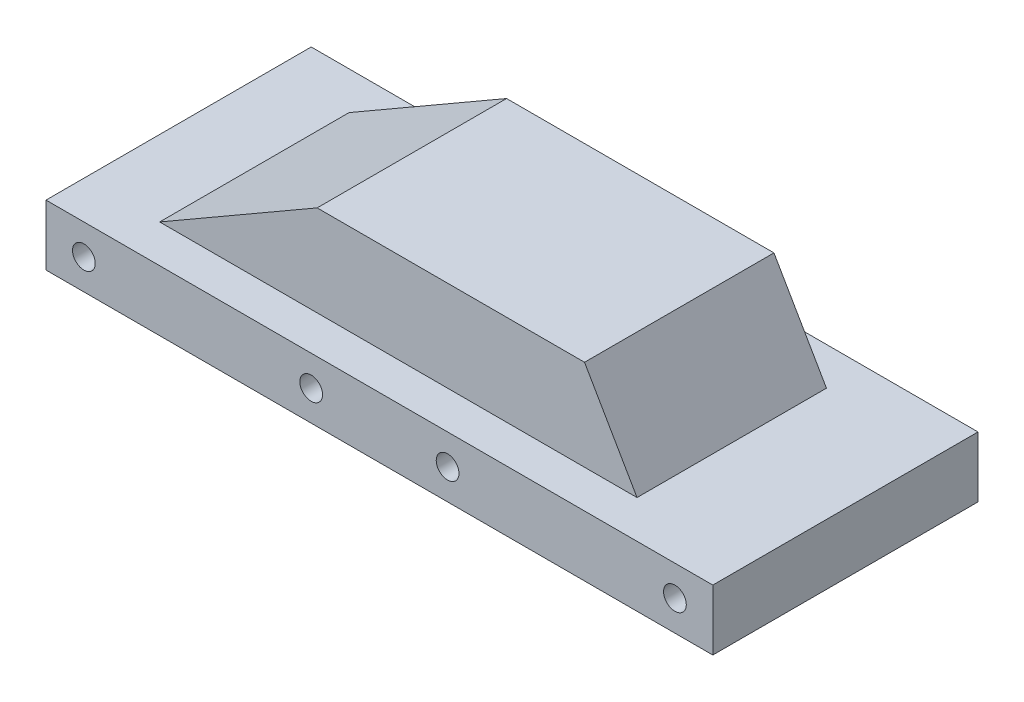
ISO-10303-21;
HEADER;
FILE_DESCRIPTION(('STEP AP214'),'2;1');
FILE_NAME('part.step','',(''),(''),'','','');
FILE_SCHEMA(('AUTOMOTIVE_DESIGN { 1 0 10303 214 1 1 1 1 }'));
ENDSEC;
DATA;
#1=APPLICATION_CONTEXT('core data for automotive mechanical design processes');
#2=APPLICATION_PROTOCOL_DEFINITION('international standard','automotive_design',2000,#1);
#3=PRODUCT_CONTEXT('',#1,'mechanical');
#4=PRODUCT('Part','Part','',(#3));
#5=PRODUCT_RELATED_PRODUCT_CATEGORY('part','',(#4));
#6=PRODUCT_DEFINITION_FORMATION('','',#4);
#7=PRODUCT_DEFINITION_CONTEXT('part definition',#1,'design');
#8=PRODUCT_DEFINITION('design','',#6,#7);
#9=PRODUCT_DEFINITION_SHAPE('','',#8);
#10=(LENGTH_UNIT() NAMED_UNIT(*) SI_UNIT(.MILLI.,.METRE.));
#11=(NAMED_UNIT(*) PLANE_ANGLE_UNIT() SI_UNIT($,.RADIAN.));
#12=(NAMED_UNIT(*) SI_UNIT($,.STERADIAN.) SOLID_ANGLE_UNIT());
#13=UNCERTAINTY_MEASURE_WITH_UNIT(LENGTH_MEASURE(1.E-05),#10,'distance_accuracy_value','');
#14=(GEOMETRIC_REPRESENTATION_CONTEXT(3) GLOBAL_UNCERTAINTY_ASSIGNED_CONTEXT((#13)) GLOBAL_UNIT_ASSIGNED_CONTEXT((#10,
#11,#12)) REPRESENTATION_CONTEXT('',''));
#15=CARTESIAN_POINT('',(0.,0.,0.));
#16=DIRECTION('',(0.,0.,1.));
#17=DIRECTION('',(1.,0.,0.));
#18=AXIS2_PLACEMENT_3D('',#15,#16,#17);
#19=CARTESIAN_POINT('',(44.,-4.,17.5));
#20=DIRECTION('',(1.,0.,0.));
#21=DIRECTION('',(0.,0.,-1.));
#22=AXIS2_PLACEMENT_3D('',#19,#20,#21);
#23=PLANE('',#22);
#24=DIRECTION('',(0.,1.,0.));
#25=VECTOR('',#24,1.);
#26=CARTESIAN_POINT('',(44.,-4.,-17.5));
#27=LINE('',#26,#25);
#28=CARTESIAN_POINT('',(44.,-4.,-17.5));
#29=VERTEX_POINT('',#28);
#30=CARTESIAN_POINT('',(44.,4.,-17.5));
#31=VERTEX_POINT('',#30);
#32=EDGE_CURVE('E33',#29,#31,#27,.T.);
#33=ORIENTED_EDGE('',*,*,#32,.T.);
#34=DIRECTION('',(0.,0.,-1.));
#35=VECTOR('',#34,1.);
#36=CARTESIAN_POINT('',(44.,4.,17.5));
#37=LINE('',#36,#35);
#38=CARTESIAN_POINT('',(44.,4.,17.5));
#39=VERTEX_POINT('',#38);
#40=EDGE_CURVE('E151',#39,#31,#37,.T.);
#41=ORIENTED_EDGE('',*,*,#40,.F.);
#42=DIRECTION('',(0.,1.,0.));
#43=VECTOR('',#42,1.);
#44=CARTESIAN_POINT('',(44.,-4.,17.5));
#45=LINE('',#44,#43);
#46=CARTESIAN_POINT('',(44.,-4.,17.5));
#47=VERTEX_POINT('',#46);
#48=EDGE_CURVE('E11',#47,#39,#45,.T.);
#49=ORIENTED_EDGE('',*,*,#48,.F.);
#50=DIRECTION('',(0.,0.,-1.));
#51=VECTOR('',#50,1.);
#52=CARTESIAN_POINT('',(44.,-4.,17.5));
#53=LINE('',#52,#51);
#54=EDGE_CURVE('E165',#47,#29,#53,.T.);
#55=ORIENTED_EDGE('',*,*,#54,.T.);
#56=EDGE_LOOP('',(#33,#41,#49,#55));
#57=FACE_BOUND('',#56,.T.);
#58=ADVANCED_FACE('F30',(#57),#23,.T.);
#59=CARTESIAN_POINT('',(-44.,-4.,17.5));
#60=DIRECTION('',(0.,0.,1.));
#61=DIRECTION('',(1.,0.,0.));
#62=AXIS2_PLACEMENT_3D('',#59,#60,#61);
#63=PLANE('',#62);
#64=CARTESIAN_POINT('',(-9.,0.,17.5));
#65=DIRECTION('',(0.,0.,-1.));
#66=DIRECTION('',(-1.,0.,0.));
#67=AXIS2_PLACEMENT_3D('',#64,#65,#66);
#68=CIRCLE('',#67,1.5);
#69=CARTESIAN_POINT('',(-10.5,0.,17.5));
#70=VERTEX_POINT('',#69);
#71=EDGE_CURVE('E130',#70,#70,#68,.T.);
#72=ORIENTED_EDGE('',*,*,#71,.T.);
#73=EDGE_LOOP('',(#72));
#74=FACE_BOUND('',#73,.T.);
#75=CARTESIAN_POINT('',(9.,0.,17.5));
#76=DIRECTION('',(0.,0.,-1.));
#77=DIRECTION('',(-1.,0.,0.));
#78=AXIS2_PLACEMENT_3D('',#75,#76,#77);
#79=CIRCLE('',#78,1.5);
#80=CARTESIAN_POINT('',(7.5,0.,17.5));
#81=VERTEX_POINT('',#80);
#82=EDGE_CURVE('E136',#81,#81,#79,.T.);
#83=ORIENTED_EDGE('',*,*,#82,.T.);
#84=EDGE_LOOP('',(#83));
#85=FACE_BOUND('',#84,.T.);
#86=CARTESIAN_POINT('',(39.,0.,17.5));
#87=DIRECTION('',(0.,0.,-1.));
#88=DIRECTION('',(-1.,0.,0.));
#89=AXIS2_PLACEMENT_3D('',#86,#87,#88);
#90=CIRCLE('',#89,1.5);
#91=CARTESIAN_POINT('',(37.5,0.,17.5));
#92=VERTEX_POINT('',#91);
#93=EDGE_CURVE('E142',#92,#92,#90,.T.);
#94=ORIENTED_EDGE('',*,*,#93,.T.);
#95=EDGE_LOOP('',(#94));
#96=FACE_BOUND('',#95,.T.);
#97=CARTESIAN_POINT('',(-39.,0.,17.5));
#98=DIRECTION('',(0.,0.,-1.));
#99=DIRECTION('',(-1.,0.,0.));
#100=AXIS2_PLACEMENT_3D('',#97,#98,#99);
#101=CIRCLE('',#100,1.5);
#102=CARTESIAN_POINT('',(-40.5,0.,17.5));
#103=VERTEX_POINT('',#102);
#104=EDGE_CURVE('E148',#103,#103,#101,.T.);
#105=ORIENTED_EDGE('',*,*,#104,.T.);
#106=EDGE_LOOP('',(#105));
#107=FACE_BOUND('',#106,.T.);
#108=ORIENTED_EDGE('',*,*,#48,.T.);
#109=DIRECTION('',(1.,0.,0.));
#110=VECTOR('',#109,1.);
#111=CARTESIAN_POINT('',(-44.,4.,17.5));
#112=LINE('',#111,#110);
#113=CARTESIAN_POINT('',(-44.,4.,17.5));
#114=VERTEX_POINT('',#113);
#115=EDGE_CURVE('E162',#114,#39,#112,.T.);
#116=ORIENTED_EDGE('',*,*,#115,.F.);
#117=DIRECTION('',(0.,1.,0.));
#118=VECTOR('',#117,1.);
#119=CARTESIAN_POINT('',(-44.,-4.,17.5));
#120=LINE('',#119,#118);
#121=CARTESIAN_POINT('',(-44.,-4.,17.5));
#122=VERTEX_POINT('',#121);
#123=EDGE_CURVE('E38',#122,#114,#120,.T.);
#124=ORIENTED_EDGE('',*,*,#123,.F.);
#125=DIRECTION('',(1.,0.,0.));
#126=VECTOR('',#125,1.);
#127=CARTESIAN_POINT('',(-44.,-4.,17.5));
#128=LINE('',#127,#126);
#129=EDGE_CURVE('E174',#122,#47,#128,.T.);
#130=ORIENTED_EDGE('',*,*,#129,.T.);
#131=EDGE_LOOP('',(#108,#116,#124,#130));
#132=FACE_BOUND('',#131,.T.);
#133=ADVANCED_FACE('F190',(#74,#85,#96,#107,#132),#63,.T.);
#134=CARTESIAN_POINT('',(-44.,-4.,17.5));
#135=DIRECTION('',(-1.,0.,0.));
#136=DIRECTION('',(0.,0.,1.));
#137=AXIS2_PLACEMENT_3D('',#134,#135,#136);
#138=PLANE('',#137);
#139=ORIENTED_EDGE('',*,*,#123,.T.);
#140=DIRECTION('',(0.,0.,1.));
#141=VECTOR('',#140,1.);
#142=CARTESIAN_POINT('',(-44.,4.,17.5));
#143=LINE('',#142,#141);
#144=CARTESIAN_POINT('',(-44.,4.,-17.5));
#145=VERTEX_POINT('',#144);
#146=EDGE_CURVE('E159',#145,#114,#143,.T.);
#147=ORIENTED_EDGE('',*,*,#146,.F.);
#148=DIRECTION('',(0.,1.,0.));
#149=VECTOR('',#148,1.);
#150=CARTESIAN_POINT('',(-44.,-4.,-17.5));
#151=LINE('',#150,#149);
#152=CARTESIAN_POINT('',(-44.,-4.,-17.5));
#153=VERTEX_POINT('',#152);
#154=EDGE_CURVE('E177',#153,#145,#151,.T.);
#155=ORIENTED_EDGE('',*,*,#154,.F.);
#156=DIRECTION('',(0.,0.,1.));
#157=VECTOR('',#156,1.);
#158=CARTESIAN_POINT('',(-44.,-4.,17.5));
#159=LINE('',#158,#157);
#160=EDGE_CURVE('E171',#153,#122,#159,.T.);
#161=ORIENTED_EDGE('',*,*,#160,.T.);
#162=EDGE_LOOP('',(#139,#147,#155,#161));
#163=FACE_BOUND('',#162,.T.);
#164=ADVANCED_FACE('F196',(#163),#138,.T.);
#165=CARTESIAN_POINT('',(-44.,-4.,-17.5));
#166=DIRECTION('',(0.,0.,-1.));
#167=DIRECTION('',(-1.,0.,0.));
#168=AXIS2_PLACEMENT_3D('',#165,#166,#167);
#169=PLANE('',#168);
#170=CARTESIAN_POINT('',(-9.,0.,-17.5));
#171=DIRECTION('',(0.,0.,-1.));
#172=DIRECTION('',(-1.,0.,0.));
#173=AXIS2_PLACEMENT_3D('',#170,#171,#172);
#174=CIRCLE('',#173,1.5);
#175=CARTESIAN_POINT('',(-10.5,0.,-17.5));
#176=VERTEX_POINT('',#175);
#177=EDGE_CURVE('E129',#176,#176,#174,.T.);
#178=ORIENTED_EDGE('',*,*,#177,.F.);
#179=EDGE_LOOP('',(#178));
#180=FACE_BOUND('',#179,.T.);
#181=CARTESIAN_POINT('',(9.,0.,-17.5));
#182=DIRECTION('',(0.,0.,-1.));
#183=DIRECTION('',(-1.,0.,0.));
#184=AXIS2_PLACEMENT_3D('',#181,#182,#183);
#185=CIRCLE('',#184,1.5);
#186=CARTESIAN_POINT('',(7.5,0.,-17.5));
#187=VERTEX_POINT('',#186);
#188=EDGE_CURVE('E133',#187,#187,#185,.T.);
#189=ORIENTED_EDGE('',*,*,#188,.F.);
#190=EDGE_LOOP('',(#189));
#191=FACE_BOUND('',#190,.T.);
#192=CARTESIAN_POINT('',(39.,0.,-17.5));
#193=DIRECTION('',(0.,0.,-1.));
#194=DIRECTION('',(-1.,0.,0.));
#195=AXIS2_PLACEMENT_3D('',#192,#193,#194);
#196=CIRCLE('',#195,1.5);
#197=CARTESIAN_POINT('',(37.5,0.,-17.5));
#198=VERTEX_POINT('',#197);
#199=EDGE_CURVE('E139',#198,#198,#196,.T.);
#200=ORIENTED_EDGE('',*,*,#199,.F.);
#201=EDGE_LOOP('',(#200));
#202=FACE_BOUND('',#201,.T.);
#203=CARTESIAN_POINT('',(-39.,0.,-17.5));
#204=DIRECTION('',(0.,0.,-1.));
#205=DIRECTION('',(-1.,0.,0.));
#206=AXIS2_PLACEMENT_3D('',#203,#204,#205);
#207=CIRCLE('',#206,1.5);
#208=CARTESIAN_POINT('',(-40.5,0.,-17.5));
#209=VERTEX_POINT('',#208);
#210=EDGE_CURVE('E145',#209,#209,#207,.T.);
#211=ORIENTED_EDGE('',*,*,#210,.F.);
#212=EDGE_LOOP('',(#211));
#213=FACE_BOUND('',#212,.T.);
#214=ORIENTED_EDGE('',*,*,#154,.T.);
#215=DIRECTION('',(-1.,0.,0.));
#216=VECTOR('',#215,1.);
#217=CARTESIAN_POINT('',(-44.,4.,-17.5));
#218=LINE('',#217,#216);
#219=EDGE_CURVE('E156',#31,#145,#218,.T.);
#220=ORIENTED_EDGE('',*,*,#219,.F.);
#221=ORIENTED_EDGE('',*,*,#32,.F.);
#222=DIRECTION('',(-1.,0.,0.));
#223=VECTOR('',#222,1.);
#224=CARTESIAN_POINT('',(-44.,-4.,-17.5));
#225=LINE('',#224,#223);
#226=EDGE_CURVE('E168',#29,#153,#225,.T.);
#227=ORIENTED_EDGE('',*,*,#226,.T.);
#228=EDGE_LOOP('',(#214,#220,#221,#227));
#229=FACE_BOUND('',#228,.T.);
#230=ADVANCED_FACE('F184',(#180,#191,#202,#213,#229),#169,.T.);
#231=CARTESIAN_POINT('',(44.,-4.,-17.5));
#232=DIRECTION('',(0.,-1.,0.));
#233=DIRECTION('',(0.,0.,-1.));
#234=AXIS2_PLACEMENT_3D('',#231,#232,#233);
#235=PLANE('',#234);
#236=ORIENTED_EDGE('',*,*,#54,.F.);
#237=ORIENTED_EDGE('',*,*,#129,.F.);
#238=ORIENTED_EDGE('',*,*,#160,.F.);
#239=ORIENTED_EDGE('',*,*,#226,.F.);
#240=EDGE_LOOP('',(#236,#237,#238,#239));
#241=FACE_BOUND('',#240,.T.);
#242=ADVANCED_FACE('F193',(#241),#235,.T.);
#243=CARTESIAN_POINT('',(44.,4.,-17.5));
#244=DIRECTION('',(0.,-1.,0.));
#245=DIRECTION('',(0.,0.,-1.));
#246=AXIS2_PLACEMENT_3D('',#243,#244,#245);
#247=PLANE('',#246);
#248=DIRECTION('',(0.,0.,-1.));
#249=VECTOR('',#248,1.);
#250=CARTESIAN_POINT('',(29.,4.,12.5));
#251=LINE('',#250,#249);
#252=CARTESIAN_POINT('',(29.,4.,12.5));
#253=VERTEX_POINT('',#252);
#254=CARTESIAN_POINT('',(29.,4.,-12.5));
#255=VERTEX_POINT('',#254);
#256=EDGE_CURVE('E46',#253,#255,#251,.T.);
#257=ORIENTED_EDGE('',*,*,#256,.F.);
#258=DIRECTION('',(1.,0.,0.));
#259=VECTOR('',#258,1.);
#260=CARTESIAN_POINT('',(-34.,4.,12.5));
#261=LINE('',#260,#259);
#262=CARTESIAN_POINT('',(-34.,4.,12.5));
#263=VERTEX_POINT('',#262);
#264=EDGE_CURVE('E51',#263,#253,#261,.T.);
#265=ORIENTED_EDGE('',*,*,#264,.F.);
#266=DIRECTION('',(0.,0.,-1.));
#267=VECTOR('',#266,1.);
#268=CARTESIAN_POINT('',(-34.,4.,12.5));
#269=LINE('',#268,#267);
#270=CARTESIAN_POINT('',(-34.,4.,-12.5));
#271=VERTEX_POINT('',#270);
#272=EDGE_CURVE('E114',#263,#271,#269,.T.);
#273=ORIENTED_EDGE('',*,*,#272,.T.);
#274=DIRECTION('',(1.,0.,0.));
#275=VECTOR('',#274,1.);
#276=CARTESIAN_POINT('',(-34.,4.,-12.5));
#277=LINE('',#276,#275);
#278=EDGE_CURVE('E118',#271,#255,#277,.T.);
#279=ORIENTED_EDGE('',*,*,#278,.T.);
#280=EDGE_LOOP('',(#257,#265,#273,#279));
#281=FACE_BOUND('',#280,.T.);
#282=ORIENTED_EDGE('',*,*,#40,.T.);
#283=ORIENTED_EDGE('',*,*,#219,.T.);
#284=ORIENTED_EDGE('',*,*,#146,.T.);
#285=ORIENTED_EDGE('',*,*,#115,.T.);
#286=EDGE_LOOP('',(#282,#283,#284,#285));
#287=FACE_BOUND('',#286,.T.);
#288=ADVANCED_FACE('F187',(#281,#287),#247,.F.);
#289=CARTESIAN_POINT('',(-39.,0.,17.5));
#290=DIRECTION('',(0.,0.,-1.));
#291=DIRECTION('',(-1.,0.,0.));
#292=AXIS2_PLACEMENT_3D('',#289,#290,#291);
#293=CYLINDRICAL_SURFACE('',#292,1.5);
#294=ORIENTED_EDGE('',*,*,#104,.F.);
#295=EDGE_LOOP('',(#294));
#296=FACE_BOUND('',#295,.T.);
#297=ORIENTED_EDGE('',*,*,#210,.T.);
#298=EDGE_LOOP('',(#297));
#299=FACE_BOUND('',#298,.T.);
#300=ADVANCED_FACE('F229',(#296,#299),#293,.F.);
#301=CARTESIAN_POINT('',(39.,0.,17.5));
#302=DIRECTION('',(0.,0.,-1.));
#303=DIRECTION('',(-1.,0.,0.));
#304=AXIS2_PLACEMENT_3D('',#301,#302,#303);
#305=CYLINDRICAL_SURFACE('',#304,1.5);
#306=ORIENTED_EDGE('',*,*,#93,.F.);
#307=EDGE_LOOP('',(#306));
#308=FACE_BOUND('',#307,.T.);
#309=ORIENTED_EDGE('',*,*,#199,.T.);
#310=EDGE_LOOP('',(#309));
#311=FACE_BOUND('',#310,.T.);
#312=ADVANCED_FACE('F234',(#308,#311),#305,.F.);
#313=CARTESIAN_POINT('',(9.,0.,17.5));
#314=DIRECTION('',(0.,0.,-1.));
#315=DIRECTION('',(-1.,0.,0.));
#316=AXIS2_PLACEMENT_3D('',#313,#314,#315);
#317=CYLINDRICAL_SURFACE('',#316,1.5);
#318=ORIENTED_EDGE('',*,*,#82,.F.);
#319=EDGE_LOOP('',(#318));
#320=FACE_BOUND('',#319,.T.);
#321=ORIENTED_EDGE('',*,*,#188,.T.);
#322=EDGE_LOOP('',(#321));
#323=FACE_BOUND('',#322,.T.);
#324=ADVANCED_FACE('F246',(#320,#323),#317,.F.);
#325=CARTESIAN_POINT('',(-9.,0.,17.5));
#326=DIRECTION('',(0.,0.,-1.));
#327=DIRECTION('',(-1.,0.,0.));
#328=AXIS2_PLACEMENT_3D('',#325,#326,#327);
#329=CYLINDRICAL_SURFACE('',#328,1.5);
#330=ORIENTED_EDGE('',*,*,#71,.F.);
#331=EDGE_LOOP('',(#330));
#332=FACE_BOUND('',#331,.T.);
#333=ORIENTED_EDGE('',*,*,#177,.T.);
#334=EDGE_LOOP('',(#333));
#335=FACE_BOUND('',#334,.T.);
#336=ADVANCED_FACE('F256',(#332,#335),#329,.F.);
#337=CARTESIAN_POINT('',(29.,4.,12.5));
#338=DIRECTION('',(-0.86602540378444,-0.499999999999998,0.));
#339=DIRECTION('',(0.499999999999998,-0.86602540378444,0.));
#340=AXIS2_PLACEMENT_3D('',#337,#338,#339);
#341=PLANE('',#340);
#342=DIRECTION('',(-0.499999999999998,0.86602540378444,0.));
#343=VECTOR('',#342,1.);
#344=CARTESIAN_POINT('',(29.,4.,-12.5));
#345=LINE('',#344,#343);
#346=CARTESIAN_POINT('',(22.0717967697245,16.,-12.5));
#347=VERTEX_POINT('',#346);
#348=EDGE_CURVE('E104',#255,#347,#345,.T.);
#349=ORIENTED_EDGE('',*,*,#348,.T.);
#350=DIRECTION('',(0.,0.,-1.));
#351=VECTOR('',#350,1.);
#352=CARTESIAN_POINT('',(22.0717967697245,16.,12.5));
#353=LINE('',#352,#351);
#354=CARTESIAN_POINT('',(22.0717967697245,16.,12.5));
#355=VERTEX_POINT('',#354);
#356=EDGE_CURVE('E101',#355,#347,#353,.T.);
#357=ORIENTED_EDGE('',*,*,#356,.F.);
#358=DIRECTION('',(-0.499999999999998,0.86602540378444,0.));
#359=VECTOR('',#358,1.);
#360=CARTESIAN_POINT('',(29.,4.,12.5));
#361=LINE('',#360,#359);
#362=EDGE_CURVE('E92',#253,#355,#361,.T.);
#363=ORIENTED_EDGE('',*,*,#362,.F.);
#364=ORIENTED_EDGE('',*,*,#256,.T.);
#365=EDGE_LOOP('',(#349,#357,#363,#364));
#366=FACE_BOUND('',#365,.T.);
#367=ADVANCED_FACE('F102',(#366),#341,.F.);
#368=CARTESIAN_POINT('',(22.0717967697245,16.,12.5));
#369=DIRECTION('',(0.,-1.,0.));
#370=DIRECTION('',(1.,0.,0.));
#371=AXIS2_PLACEMENT_3D('',#368,#369,#370);
#372=PLANE('',#371);
#373=DIRECTION('',(-1.,0.,0.));
#374=VECTOR('',#373,1.);
#375=CARTESIAN_POINT('',(22.0717967697245,16.,-12.5));
#376=LINE('',#375,#374);
#377=CARTESIAN_POINT('',(-13.2153903091736,16.,-12.5));
#378=VERTEX_POINT('',#377);
#379=EDGE_CURVE('E121',#347,#378,#376,.T.);
#380=ORIENTED_EDGE('',*,*,#379,.T.);
#381=DIRECTION('',(0.,0.,-1.));
#382=VECTOR('',#381,1.);
#383=CARTESIAN_POINT('',(-13.2153903091736,16.,12.5));
#384=LINE('',#383,#382);
#385=CARTESIAN_POINT('',(-13.2153903091736,16.,12.5));
#386=VERTEX_POINT('',#385);
#387=EDGE_CURVE('E107',#386,#378,#384,.T.);
#388=ORIENTED_EDGE('',*,*,#387,.F.);
#389=DIRECTION('',(-1.,0.,0.));
#390=VECTOR('',#389,1.);
#391=CARTESIAN_POINT('',(22.0717967697245,16.,12.5));
#392=LINE('',#391,#390);
#393=EDGE_CURVE('E96',#355,#386,#392,.T.);
#394=ORIENTED_EDGE('',*,*,#393,.F.);
#395=ORIENTED_EDGE('',*,*,#356,.T.);
#396=EDGE_LOOP('',(#380,#388,#394,#395));
#397=FACE_BOUND('',#396,.T.);
#398=ADVANCED_FACE('F109',(#397),#372,.F.);
#399=CARTESIAN_POINT('',(-13.2153903091736,16.,12.5));
#400=DIRECTION('',(0.500000000000001,-0.866025403784438,0.));
#401=DIRECTION('',(0.866025403784438,0.500000000000001,0.));
#402=AXIS2_PLACEMENT_3D('',#399,#400,#401);
#403=PLANE('',#402);
#404=DIRECTION('',(-0.866025403784438,-0.500000000000001,0.));
#405=VECTOR('',#404,1.);
#406=CARTESIAN_POINT('',(-13.2153903091736,16.,-12.5));
#407=LINE('',#406,#405);
#408=EDGE_CURVE('E123',#378,#271,#407,.T.);
#409=ORIENTED_EDGE('',*,*,#408,.T.);
#410=ORIENTED_EDGE('',*,*,#272,.F.);
#411=DIRECTION('',(-0.866025403784438,-0.500000000000001,0.));
#412=VECTOR('',#411,1.);
#413=CARTESIAN_POINT('',(-13.2153903091736,16.,12.5));
#414=LINE('',#413,#412);
#415=EDGE_CURVE('E112',#386,#263,#414,.T.);
#416=ORIENTED_EDGE('',*,*,#415,.F.);
#417=ORIENTED_EDGE('',*,*,#387,.T.);
#418=EDGE_LOOP('',(#409,#410,#416,#417));
#419=FACE_BOUND('',#418,.T.);
#420=ADVANCED_FACE('F289',(#419),#403,.F.);
#421=CARTESIAN_POINT('',(29.,3.99999999999999,12.5));
#422=DIRECTION('',(0.,0.,1.));
#423=DIRECTION('',(1.,0.,0.));
#424=AXIS2_PLACEMENT_3D('',#421,#422,#423);
#425=PLANE('',#424);
#426=ORIENTED_EDGE('',*,*,#264,.T.);
#427=ORIENTED_EDGE('',*,*,#362,.T.);
#428=ORIENTED_EDGE('',*,*,#393,.T.);
#429=ORIENTED_EDGE('',*,*,#415,.T.);
#430=EDGE_LOOP('',(#426,#427,#428,#429));
#431=FACE_BOUND('',#430,.T.);
#432=ADVANCED_FACE('F94',(#431),#425,.T.);
#433=CARTESIAN_POINT('',(29.,3.99999999999999,-12.5));
#434=DIRECTION('',(0.,0.,1.));
#435=DIRECTION('',(1.,0.,0.));
#436=AXIS2_PLACEMENT_3D('',#433,#434,#435);
#437=PLANE('',#436);
#438=ORIENTED_EDGE('',*,*,#278,.F.);
#439=ORIENTED_EDGE('',*,*,#408,.F.);
#440=ORIENTED_EDGE('',*,*,#379,.F.);
#441=ORIENTED_EDGE('',*,*,#348,.F.);
#442=EDGE_LOOP('',(#438,#439,#440,#441));
#443=FACE_BOUND('',#442,.T.);
#444=ADVANCED_FACE('F307',(#443),#437,.F.);
#445=CLOSED_SHELL('',(#58,#133,#164,#230,#242,#288,#300,#312,#324,#336,#367,#398,#420,#432,#444));
#446=MANIFOLD_SOLID_BREP('B2',#445);
#447=ADVANCED_BREP_SHAPE_REPRESENTATION('',(#18,#446),#14);
#448=SHAPE_DEFINITION_REPRESENTATION(#9,#447);
ENDSEC;
END-ISO-10303-21;
